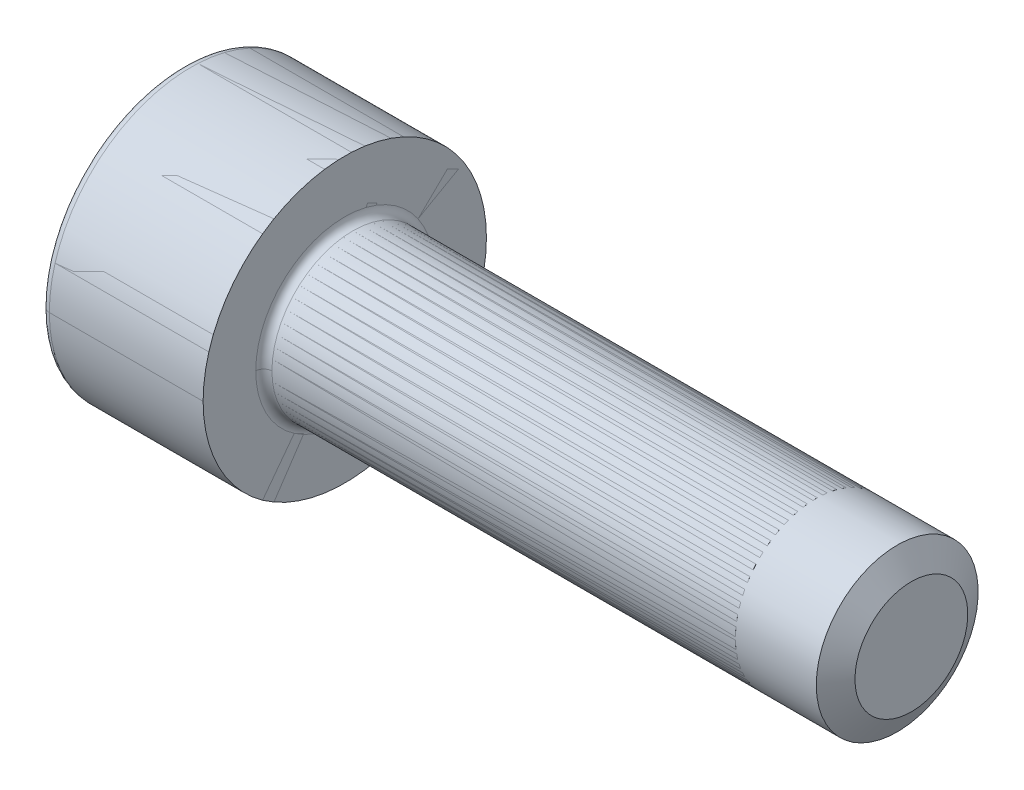
ISO-10303-21;
HEADER;
FILE_DESCRIPTION(('STEP AP214'),'2;1');
FILE_NAME('part.step','',(''),(''),'','','');
FILE_SCHEMA(('AUTOMOTIVE_DESIGN { 1 0 10303 214 1 1 1 1 }'));
ENDSEC;
DATA;
#1=APPLICATION_CONTEXT('core data for automotive mechanical design processes');
#2=APPLICATION_PROTOCOL_DEFINITION('international standard','automotive_design',2000,#1);
#3=PRODUCT_CONTEXT('',#1,'mechanical');
#4=PRODUCT('Part','Part','',(#3));
#5=PRODUCT_RELATED_PRODUCT_CATEGORY('part','',(#4));
#6=PRODUCT_DEFINITION_FORMATION('','',#4);
#7=PRODUCT_DEFINITION_CONTEXT('part definition',#1,'design');
#8=PRODUCT_DEFINITION('design','',#6,#7);
#9=PRODUCT_DEFINITION_SHAPE('','',#8);
#10=(LENGTH_UNIT() NAMED_UNIT(*) SI_UNIT(.MILLI.,.METRE.));
#11=(NAMED_UNIT(*) PLANE_ANGLE_UNIT() SI_UNIT($,.RADIAN.));
#12=(NAMED_UNIT(*) SI_UNIT($,.STERADIAN.) SOLID_ANGLE_UNIT());
#13=UNCERTAINTY_MEASURE_WITH_UNIT(LENGTH_MEASURE(1.E-05),#10,'distance_accuracy_value','');
#14=(GEOMETRIC_REPRESENTATION_CONTEXT(3) GLOBAL_UNCERTAINTY_ASSIGNED_CONTEXT((#13)) GLOBAL_UNIT_ASSIGNED_CONTEXT((#10,
#11,#12)) REPRESENTATION_CONTEXT('',''));
#15=CARTESIAN_POINT('',(0.,0.,0.));
#16=DIRECTION('',(0.,0.,1.));
#17=DIRECTION('',(1.,0.,0.));
#18=AXIS2_PLACEMENT_3D('',#15,#16,#17);
#19=CARTESIAN_POINT('',(0.2,0.,0.));
#20=DIRECTION('',(-1.,0.,0.));
#21=DIRECTION('',(0.,0.,1.));
#22=AXIS2_PLACEMENT_3D('',#19,#20,#21);
#23=TOROIDAL_SURFACE('',#22,3.3,0.2);
#24=CARTESIAN_POINT('',(0.2,0.,-3.3));
#25=DIRECTION('',(0.,1.,0.));
#26=DIRECTION('',(0.,0.,1.));
#27=AXIS2_PLACEMENT_3D('',#24,#25,#26);
#28=CIRCLE('',#27,0.2);
#29=CARTESIAN_POINT('',(0.2,0.,-3.5));
#30=VERTEX_POINT('',#29);
#31=CARTESIAN_POINT('',(0.,0.,-3.3));
#32=VERTEX_POINT('',#31);
#33=EDGE_CURVE('P0_E161',#30,#32,#28,.T.);
#34=ORIENTED_EDGE('',*,*,#33,.F.);
#35=CARTESIAN_POINT('',(0.2,0.,0.));
#36=DIRECTION('',(1.,0.,0.));
#37=DIRECTION('',(0.,0.,1.));
#38=AXIS2_PLACEMENT_3D('',#35,#36,#37);
#39=CIRCLE('',#38,3.5);
#40=CARTESIAN_POINT('',(0.2,0.,3.5));
#41=VERTEX_POINT('',#40);
#42=EDGE_CURVE('P0_E155',#41,#30,#39,.T.);
#43=ORIENTED_EDGE('',*,*,#42,.F.);
#44=CARTESIAN_POINT('',(0.2,0.,3.3));
#45=DIRECTION('',(0.,-1.,0.));
#46=DIRECTION('',(0.,0.,-1.));
#47=AXIS2_PLACEMENT_3D('',#44,#45,#46);
#48=CIRCLE('',#47,0.2);
#49=CARTESIAN_POINT('',(0.,0.,3.3));
#50=VERTEX_POINT('',#49);
#51=EDGE_CURVE('P0_E158',#41,#50,#48,.T.);
#52=ORIENTED_EDGE('',*,*,#51,.T.);
#53=CARTESIAN_POINT('',(0.,0.,0.));
#54=DIRECTION('',(-1.,0.,0.));
#55=DIRECTION('',(0.,0.,1.));
#56=AXIS2_PLACEMENT_3D('',#53,#54,#55);
#57=CIRCLE('',#56,3.3);
#58=EDGE_CURVE('P0_E42',#32,#50,#57,.T.);
#59=ORIENTED_EDGE('',*,*,#58,.F.);
#60=EDGE_LOOP('',(#34,#43,#52,#59));
#61=FACE_BOUND('',#60,.T.);
#62=ADVANCED_FACE('P0_F38',(#61),#23,.T.);
#63=CARTESIAN_POINT('',(2.,-0.86,1.48956369450923));
#64=DIRECTION('',(-1.,0.,0.));
#65=DIRECTION('',(0.,0.,1.));
#66=AXIS2_PLACEMENT_3D('',#63,#64,#65);
#67=PLANE('',#66);
#68=DIRECTION('',(0.,0.5,0.866025403784439));
#69=VECTOR('',#68,1.);
#70=CARTESIAN_POINT('',(2.,-1.72,0.));
#71=LINE('',#70,#69);
#72=CARTESIAN_POINT('',(2.,-1.72,0.));
#73=VERTEX_POINT('',#72);
#74=CARTESIAN_POINT('',(2.,-0.86,1.48956369450923));
#75=VERTEX_POINT('',#74);
#76=EDGE_CURVE('P0_E295',#73,#75,#71,.T.);
#77=ORIENTED_EDGE('',*,*,#76,.T.);
#78=DIRECTION('',(0.,1.,0.));
#79=VECTOR('',#78,1.);
#80=CARTESIAN_POINT('',(2.,-0.86,1.48956369450923));
#81=LINE('',#80,#79);
#82=CARTESIAN_POINT('',(2.,0.86,1.48956369450923));
#83=VERTEX_POINT('',#82);
#84=EDGE_CURVE('P0_E11',#75,#83,#81,.T.);
#85=ORIENTED_EDGE('',*,*,#84,.T.);
#86=DIRECTION('',(0.,0.5,-0.866025403784439));
#87=VECTOR('',#86,1.);
#88=CARTESIAN_POINT('',(2.,0.86,1.48956369450923));
#89=LINE('',#88,#87);
#90=CARTESIAN_POINT('',(2.,1.72,0.));
#91=VERTEX_POINT('',#90);
#92=EDGE_CURVE('P0_E220',#83,#91,#89,.T.);
#93=ORIENTED_EDGE('',*,*,#92,.T.);
#94=DIRECTION('',(0.,-0.5,-0.866025403784439));
#95=VECTOR('',#94,1.);
#96=CARTESIAN_POINT('',(2.,1.72,0.));
#97=LINE('',#96,#95);
#98=CARTESIAN_POINT('',(2.,0.86,-1.48956369450923));
#99=VERTEX_POINT('',#98);
#100=EDGE_CURVE('P0_E221',#91,#99,#97,.T.);
#101=ORIENTED_EDGE('',*,*,#100,.T.);
#102=DIRECTION('',(0.,-1.,0.));
#103=VECTOR('',#102,1.);
#104=CARTESIAN_POINT('',(2.,0.86,-1.48956369450923));
#105=LINE('',#104,#103);
#106=CARTESIAN_POINT('',(2.,-0.86,-1.48956369450923));
#107=VERTEX_POINT('',#106);
#108=EDGE_CURVE('P0_E134',#99,#107,#105,.T.);
#109=ORIENTED_EDGE('',*,*,#108,.T.);
#110=DIRECTION('',(0.,-0.5,0.866025403784439));
#111=VECTOR('',#110,1.);
#112=CARTESIAN_POINT('',(2.,-0.86,-1.48956369450923));
#113=LINE('',#112,#111);
#114=EDGE_CURVE('P0_E126',#107,#73,#113,.T.);
#115=ORIENTED_EDGE('',*,*,#114,.T.);
#116=EDGE_LOOP('',(#77,#85,#93,#101,#109,#115));
#117=FACE_BOUND('',#116,.T.);
#118=ADVANCED_FACE('P0_F333',(#117),#67,.T.);
#119=CARTESIAN_POINT('',(2.,-0.86,1.48956369450923));
#120=DIRECTION('',(0.,0.,1.));
#121=DIRECTION('',(0.,-1.,0.));
#122=AXIS2_PLACEMENT_3D('',#119,#120,#121);
#123=PLANE('',#122);
#124=DIRECTION('',(0.,1.,0.));
#125=VECTOR('',#124,1.);
#126=CARTESIAN_POINT('',(0.,-0.86,1.48956369450923));
#127=LINE('',#126,#125);
#128=CARTESIAN_POINT('',(0.,-0.86,1.48956369450923));
#129=VERTEX_POINT('',#128);
#130=CARTESIAN_POINT('',(0.,0.86,1.48956369450923));
#131=VERTEX_POINT('',#130);
#132=EDGE_CURVE('P0_E168',#129,#131,#127,.T.);
#133=ORIENTED_EDGE('',*,*,#132,.T.);
#134=DIRECTION('',(-1.,0.,0.));
#135=VECTOR('',#134,1.);
#136=CARTESIAN_POINT('',(2.,0.86,1.48956369450923));
#137=LINE('',#136,#135);
#138=EDGE_CURVE('P0_E49',#83,#131,#137,.T.);
#139=ORIENTED_EDGE('',*,*,#138,.F.);
#140=ORIENTED_EDGE('',*,*,#84,.F.);
#141=DIRECTION('',(-1.,0.,0.));
#142=VECTOR('',#141,1.);
#143=CARTESIAN_POINT('',(2.,-0.86,1.48956369450923));
#144=LINE('',#143,#142);
#145=EDGE_CURVE('P0_E293',#75,#129,#144,.T.);
#146=ORIENTED_EDGE('',*,*,#145,.T.);
#147=EDGE_LOOP('',(#133,#139,#140,#146));
#148=FACE_BOUND('',#147,.T.);
#149=ADVANCED_FACE('P0_F330',(#148),#123,.F.);
#150=CARTESIAN_POINT('',(2.,0.86,1.48956369450923));
#151=DIRECTION('',(0.,0.866025403784439,0.5));
#152=DIRECTION('',(1.,0.,0.));
#153=AXIS2_PLACEMENT_3D('',#150,#151,#152);
#154=PLANE('',#153);
#155=DIRECTION('',(0.,0.5,-0.866025403784439));
#156=VECTOR('',#155,1.);
#157=CARTESIAN_POINT('',(0.,0.86,1.48956369450923));
#158=LINE('',#157,#156);
#159=CARTESIAN_POINT('',(0.,1.72,0.));
#160=VERTEX_POINT('',#159);
#161=EDGE_CURVE('P0_E255',#131,#160,#158,.T.);
#162=ORIENTED_EDGE('',*,*,#161,.T.);
#163=DIRECTION('',(-1.,0.,0.));
#164=VECTOR('',#163,1.);
#165=CARTESIAN_POINT('',(2.,1.72,0.));
#166=LINE('',#165,#164);
#167=EDGE_CURVE('P0_E218',#91,#160,#166,.T.);
#168=ORIENTED_EDGE('',*,*,#167,.F.);
#169=ORIENTED_EDGE('',*,*,#92,.F.);
#170=ORIENTED_EDGE('',*,*,#138,.T.);
#171=EDGE_LOOP('',(#162,#168,#169,#170));
#172=FACE_BOUND('',#171,.T.);
#173=ADVANCED_FACE('P0_F332',(#172),#154,.F.);
#174=CARTESIAN_POINT('',(2.,1.72,0.));
#175=DIRECTION('',(0.,0.866025403784439,-0.5));
#176=DIRECTION('',(-1.,0.,0.));
#177=AXIS2_PLACEMENT_3D('',#174,#175,#176);
#178=PLANE('',#177);
#179=DIRECTION('',(0.,-0.5,-0.866025403784439));
#180=VECTOR('',#179,1.);
#181=CARTESIAN_POINT('',(0.,1.72,0.));
#182=LINE('',#181,#180);
#183=CARTESIAN_POINT('',(0.,0.86,-1.48956369450923));
#184=VERTEX_POINT('',#183);
#185=EDGE_CURVE('P0_E202',#160,#184,#182,.T.);
#186=ORIENTED_EDGE('',*,*,#185,.T.);
#187=DIRECTION('',(-1.,0.,0.));
#188=VECTOR('',#187,1.);
#189=CARTESIAN_POINT('',(2.,0.86,-1.48956369450923));
#190=LINE('',#189,#188);
#191=EDGE_CURVE('P0_E251',#99,#184,#190,.T.);
#192=ORIENTED_EDGE('',*,*,#191,.F.);
#193=ORIENTED_EDGE('',*,*,#100,.F.);
#194=ORIENTED_EDGE('',*,*,#167,.T.);
#195=EDGE_LOOP('',(#186,#192,#193,#194));
#196=FACE_BOUND('',#195,.T.);
#197=ADVANCED_FACE('P0_F271',(#196),#178,.F.);
#198=CARTESIAN_POINT('',(2.,0.86,-1.48956369450923));
#199=DIRECTION('',(0.,0.,-1.));
#200=DIRECTION('',(0.,-1.,0.));
#201=AXIS2_PLACEMENT_3D('',#198,#199,#200);
#202=PLANE('',#201);
#203=DIRECTION('',(0.,-1.,0.));
#204=VECTOR('',#203,1.);
#205=CARTESIAN_POINT('',(0.,0.86,-1.48956369450923));
#206=LINE('',#205,#204);
#207=CARTESIAN_POINT('',(0.,-0.86,-1.48956369450923));
#208=VERTEX_POINT('',#207);
#209=EDGE_CURVE('P0_E239',#184,#208,#206,.T.);
#210=ORIENTED_EDGE('',*,*,#209,.T.);
#211=DIRECTION('',(-1.,0.,0.));
#212=VECTOR('',#211,1.);
#213=CARTESIAN_POINT('',(2.,-0.86,-1.48956369450923));
#214=LINE('',#213,#212);
#215=EDGE_CURVE('P0_E227',#107,#208,#214,.T.);
#216=ORIENTED_EDGE('',*,*,#215,.F.);
#217=ORIENTED_EDGE('',*,*,#108,.F.);
#218=ORIENTED_EDGE('',*,*,#191,.T.);
#219=EDGE_LOOP('',(#210,#216,#217,#218));
#220=FACE_BOUND('',#219,.T.);
#221=ADVANCED_FACE('P0_F281',(#220),#202,.F.);
#222=CARTESIAN_POINT('',(2.,-0.86,-1.48956369450923));
#223=DIRECTION('',(0.,-0.866025403784439,-0.5));
#224=DIRECTION('',(0.,0.5,-0.866025403784439));
#225=AXIS2_PLACEMENT_3D('',#222,#223,#224);
#226=PLANE('',#225);
#227=DIRECTION('',(0.,-0.5,0.866025403784439));
#228=VECTOR('',#227,1.);
#229=CARTESIAN_POINT('',(0.,-0.86,-1.48956369450923));
#230=LINE('',#229,#228);
#231=CARTESIAN_POINT('',(0.,-1.72,0.));
#232=VERTEX_POINT('',#231);
#233=EDGE_CURVE('P0_E238',#208,#232,#230,.T.);
#234=ORIENTED_EDGE('',*,*,#233,.T.);
#235=DIRECTION('',(-1.,0.,0.));
#236=VECTOR('',#235,1.);
#237=CARTESIAN_POINT('',(2.,-1.72,0.));
#238=LINE('',#237,#236);
#239=EDGE_CURVE('P0_E248',#73,#232,#238,.T.);
#240=ORIENTED_EDGE('',*,*,#239,.F.);
#241=ORIENTED_EDGE('',*,*,#114,.F.);
#242=ORIENTED_EDGE('',*,*,#215,.T.);
#243=EDGE_LOOP('',(#234,#240,#241,#242));
#244=FACE_BOUND('',#243,.T.);
#245=ADVANCED_FACE('P0_F327',(#244),#226,.F.);
#246=CARTESIAN_POINT('',(2.,-1.72,0.));
#247=DIRECTION('',(0.,-0.866025403784439,0.5));
#248=DIRECTION('',(-1.,0.,0.));
#249=AXIS2_PLACEMENT_3D('',#246,#247,#248);
#250=PLANE('',#249);
#251=DIRECTION('',(0.,0.5,0.866025403784439));
#252=VECTOR('',#251,1.);
#253=CARTESIAN_POINT('',(0.,-1.72,0.));
#254=LINE('',#253,#252);
#255=EDGE_CURVE('P0_E234',#232,#129,#254,.T.);
#256=ORIENTED_EDGE('',*,*,#255,.T.);
#257=ORIENTED_EDGE('',*,*,#145,.F.);
#258=ORIENTED_EDGE('',*,*,#76,.F.);
#259=ORIENTED_EDGE('',*,*,#239,.T.);
#260=EDGE_LOOP('',(#256,#257,#258,#259));
#261=FACE_BOUND('',#260,.T.);
#262=ADVANCED_FACE('P0_F325',(#261),#250,.F.);
#263=CARTESIAN_POINT('',(4.2,0.,0.));
#264=DIRECTION('',(1.,0.,0.));
#265=DIRECTION('',(0.,0.,-1.));
#266=AXIS2_PLACEMENT_3D('',#263,#264,#265);
#267=TOROIDAL_SURFACE('',#266,2.2,0.2);
#268=CARTESIAN_POINT('',(4.2,0.,2.2));
#269=DIRECTION('',(0.,1.,0.));
#270=DIRECTION('',(0.,0.,1.));
#271=AXIS2_PLACEMENT_3D('',#268,#269,#270);
#272=CIRCLE('',#271,0.2);
#273=CARTESIAN_POINT('',(4.2,0.,2.));
#274=VERTEX_POINT('',#273);
#275=CARTESIAN_POINT('',(4.,0.,2.2));
#276=VERTEX_POINT('',#275);
#277=EDGE_CURVE('P0_E300',#274,#276,#272,.T.);
#278=ORIENTED_EDGE('',*,*,#277,.F.);
#279=CARTESIAN_POINT('',(4.2,0.,0.));
#280=DIRECTION('',(1.,0.,0.));
#281=DIRECTION('',(0.,0.,-1.));
#282=AXIS2_PLACEMENT_3D('',#279,#280,#281);
#283=CIRCLE('',#282,2.);
#284=CARTESIAN_POINT('',(4.2,0.,-2.));
#285=VERTEX_POINT('',#284);
#286=EDGE_CURVE('P0_E204',#285,#274,#283,.T.);
#287=ORIENTED_EDGE('',*,*,#286,.F.);
#288=CARTESIAN_POINT('',(4.2,0.,-2.2));
#289=DIRECTION('',(0.,-1.,0.));
#290=DIRECTION('',(0.,0.,-1.));
#291=AXIS2_PLACEMENT_3D('',#288,#289,#290);
#292=CIRCLE('',#291,0.2);
#293=CARTESIAN_POINT('',(4.,0.,-2.2));
#294=VERTEX_POINT('',#293);
#295=EDGE_CURVE('P0_E179',#285,#294,#292,.T.);
#296=ORIENTED_EDGE('',*,*,#295,.T.);
#297=CARTESIAN_POINT('',(4.,0.,0.));
#298=DIRECTION('',(1.,0.,0.));
#299=DIRECTION('',(0.,0.,-1.));
#300=AXIS2_PLACEMENT_3D('',#297,#298,#299);
#301=CIRCLE('',#300,2.2);
#302=EDGE_CURVE('P0_E245',#294,#276,#301,.T.);
#303=ORIENTED_EDGE('',*,*,#302,.T.);
#304=EDGE_LOOP('',(#278,#287,#296,#303));
#305=FACE_BOUND('',#304,.T.);
#306=ADVANCED_FACE('P0_F357',(#305),#267,.F.);
#307=CARTESIAN_POINT('',(4.,3.5,0.));
#308=DIRECTION('',(1.,0.,0.));
#309=DIRECTION('',(0.,1.,0.));
#310=AXIS2_PLACEMENT_3D('',#307,#308,#309);
#311=PLANE('',#310);
#312=ORIENTED_EDGE('',*,*,#302,.F.);
#313=CARTESIAN_POINT('',(4.,0.,0.));
#314=DIRECTION('',(1.,0.,0.));
#315=DIRECTION('',(0.,0.,-1.));
#316=AXIS2_PLACEMENT_3D('',#313,#314,#315);
#317=CIRCLE('',#316,2.2);
#318=EDGE_CURVE('P0_E303',#276,#294,#317,.T.);
#319=ORIENTED_EDGE('',*,*,#318,.F.);
#320=EDGE_LOOP('',(#312,#319));
#321=FACE_BOUND('',#320,.T.);
#322=CARTESIAN_POINT('',(4.,0.,0.));
#323=DIRECTION('',(1.,0.,0.));
#324=DIRECTION('',(0.,0.,-1.));
#325=AXIS2_PLACEMENT_3D('',#322,#323,#324);
#326=CIRCLE('',#325,3.5);
#327=CARTESIAN_POINT('',(4.,0.,-3.5));
#328=VERTEX_POINT('',#327);
#329=CARTESIAN_POINT('',(4.,0.,3.5));
#330=VERTEX_POINT('',#329);
#331=EDGE_CURVE('P0_E178',#328,#330,#326,.T.);
#332=ORIENTED_EDGE('',*,*,#331,.T.);
#333=CARTESIAN_POINT('',(4.,0.,0.));
#334=DIRECTION('',(1.,0.,0.));
#335=DIRECTION('',(0.,0.,-1.));
#336=AXIS2_PLACEMENT_3D('',#333,#334,#335);
#337=CIRCLE('',#336,3.5);
#338=EDGE_CURVE('P0_E167',#330,#328,#337,.T.);
#339=ORIENTED_EDGE('',*,*,#338,.T.);
#340=EDGE_LOOP('',(#332,#339));
#341=FACE_BOUND('',#340,.T.);
#342=ADVANCED_FACE('P0_F366',(#321,#341),#311,.T.);
#343=CARTESIAN_POINT('',(0.,0.,0.));
#344=DIRECTION('',(1.,0.,0.));
#345=DIRECTION('',(0.,0.,-1.));
#346=AXIS2_PLACEMENT_3D('',#343,#344,#345);
#347=CYLINDRICAL_SURFACE('',#346,3.5);
#348=DIRECTION('',(1.,0.,0.));
#349=VECTOR('',#348,1.);
#350=CARTESIAN_POINT('',(0.,0.,3.5));
#351=LINE('',#350,#349);
#352=EDGE_CURVE('P0_E171',#41,#330,#351,.T.);
#353=ORIENTED_EDGE('',*,*,#352,.F.);
#354=ORIENTED_EDGE('',*,*,#42,.T.);
#355=DIRECTION('',(1.,0.,0.));
#356=VECTOR('',#355,1.);
#357=CARTESIAN_POINT('',(0.,0.,-3.5));
#358=LINE('',#357,#356);
#359=EDGE_CURVE('P0_E189',#30,#328,#358,.T.);
#360=ORIENTED_EDGE('',*,*,#359,.T.);
#361=ORIENTED_EDGE('',*,*,#338,.F.);
#362=EDGE_LOOP('',(#353,#354,#360,#361));
#363=FACE_BOUND('',#362,.T.);
#364=ADVANCED_FACE('P0_F172',(#363),#347,.T.);
#365=CARTESIAN_POINT('',(0.,0.,0.));
#366=DIRECTION('',(-1.,0.,0.));
#367=DIRECTION('',(0.,0.,1.));
#368=AXIS2_PLACEMENT_3D('',#365,#366,#367);
#369=PLANE('',#368);
#370=ORIENTED_EDGE('',*,*,#255,.F.);
#371=ORIENTED_EDGE('',*,*,#233,.F.);
#372=ORIENTED_EDGE('',*,*,#209,.F.);
#373=ORIENTED_EDGE('',*,*,#185,.F.);
#374=ORIENTED_EDGE('',*,*,#161,.F.);
#375=ORIENTED_EDGE('',*,*,#132,.F.);
#376=EDGE_LOOP('',(#370,#371,#372,#373,#374,#375));
#377=FACE_BOUND('',#376,.T.);
#378=CARTESIAN_POINT('',(0.,0.,0.));
#379=DIRECTION('',(-1.,0.,0.));
#380=DIRECTION('',(0.,0.,1.));
#381=AXIS2_PLACEMENT_3D('',#378,#379,#380);
#382=CIRCLE('',#381,3.3);
#383=EDGE_CURVE('P0_E184',#50,#32,#382,.T.);
#384=ORIENTED_EDGE('',*,*,#383,.T.);
#385=ORIENTED_EDGE('',*,*,#58,.T.);
#386=EDGE_LOOP('',(#384,#385));
#387=FACE_BOUND('',#386,.T.);
#388=ADVANCED_FACE('P0_F277',(#377,#387),#369,.T.);
#389=CARTESIAN_POINT('',(0.,0.,0.));
#390=DIRECTION('',(1.,0.,0.));
#391=DIRECTION('',(0.,0.,-1.));
#392=AXIS2_PLACEMENT_3D('',#389,#390,#391);
#393=CYLINDRICAL_SURFACE('',#392,2.);
#394=ORIENTED_EDGE('',*,*,#286,.T.);
#395=DIRECTION('',(1.,0.,0.));
#396=VECTOR('',#395,1.);
#397=CARTESIAN_POINT('',(0.,0.,2.));
#398=LINE('',#397,#396);
#399=CARTESIAN_POINT('',(15.65,0.,2.));
#400=VERTEX_POINT('',#399);
#401=EDGE_CURVE('P0_E209',#274,#400,#398,.T.);
#402=ORIENTED_EDGE('',*,*,#401,.T.);
#403=ORIENTED_EDGE('',*,*,#401,.F.);
#404=CARTESIAN_POINT('',(4.2,0.,0.));
#405=DIRECTION('',(1.,0.,0.));
#406=DIRECTION('',(0.,0.,-1.));
#407=AXIS2_PLACEMENT_3D('',#404,#405,#406);
#408=CIRCLE('',#407,2.);
#409=EDGE_CURVE('P0_E186',#274,#285,#408,.T.);
#410=ORIENTED_EDGE('',*,*,#409,.T.);
#411=DIRECTION('',(1.,0.,0.));
#412=VECTOR('',#411,1.);
#413=CARTESIAN_POINT('',(0.,0.,-2.));
#414=LINE('',#413,#412);
#415=CARTESIAN_POINT('',(15.65,0.,-2.));
#416=VERTEX_POINT('',#415);
#417=EDGE_CURVE('P0_E226',#285,#416,#414,.T.);
#418=ORIENTED_EDGE('',*,*,#417,.T.);
#419=ORIENTED_EDGE('',*,*,#417,.F.);
#420=EDGE_LOOP('',(#394,#402,#403,#410,#418,#419));
#421=FACE_BOUND('',#420,.T.);
#422=CARTESIAN_POINT('',(17.65,0.,0.));
#423=DIRECTION('',(-1.,0.,0.));
#424=DIRECTION('',(0.,0.,1.));
#425=AXIS2_PLACEMENT_3D('',#422,#423,#424);
#426=CIRCLE('',#425,2.);
#427=CARTESIAN_POINT('',(17.65,0.,2.));
#428=VERTEX_POINT('',#427);
#429=EDGE_CURVE('P0_E191',#428,#428,#426,.T.);
#430=ORIENTED_EDGE('',*,*,#429,.T.);
#431=EDGE_LOOP('',(#430));
#432=FACE_BOUND('',#431,.T.);
#433=ADVANCED_FACE('P0_F360',(#421,#432),#393,.T.);
#434=CARTESIAN_POINT('',(0.,0.,0.));
#435=DIRECTION('',(1.,0.,0.));
#436=DIRECTION('',(0.,0.,-1.));
#437=AXIS2_PLACEMENT_3D('',#434,#435,#436);
#438=CYLINDRICAL_SURFACE('',#437,3.5);
#439=CARTESIAN_POINT('',(0.2,0.,0.));
#440=DIRECTION('',(1.,0.,0.));
#441=DIRECTION('',(0.,0.,1.));
#442=AXIS2_PLACEMENT_3D('',#439,#440,#441);
#443=CIRCLE('',#442,3.5);
#444=EDGE_CURVE('P0_E182',#30,#41,#443,.T.);
#445=ORIENTED_EDGE('',*,*,#444,.T.);
#446=ORIENTED_EDGE('',*,*,#352,.T.);
#447=ORIENTED_EDGE('',*,*,#331,.F.);
#448=ORIENTED_EDGE('',*,*,#359,.F.);
#449=EDGE_LOOP('',(#445,#446,#447,#448));
#450=FACE_BOUND('',#449,.T.);
#451=ADVANCED_FACE('P0_F188',(#450),#438,.T.);
#452=CARTESIAN_POINT('',(4.2,0.,0.));
#453=DIRECTION('',(1.,0.,0.));
#454=DIRECTION('',(0.,0.,-1.));
#455=AXIS2_PLACEMENT_3D('',#452,#453,#454);
#456=TOROIDAL_SURFACE('',#455,2.2,0.2);
#457=ORIENTED_EDGE('',*,*,#409,.F.);
#458=ORIENTED_EDGE('',*,*,#277,.T.);
#459=ORIENTED_EDGE('',*,*,#318,.T.);
#460=ORIENTED_EDGE('',*,*,#295,.F.);
#461=EDGE_LOOP('',(#457,#458,#459,#460));
#462=FACE_BOUND('',#461,.T.);
#463=ADVANCED_FACE('P0_F372',(#462),#456,.F.);
#464=CARTESIAN_POINT('',(0.2,0.,0.));
#465=DIRECTION('',(-1.,0.,0.));
#466=DIRECTION('',(0.,0.,1.));
#467=AXIS2_PLACEMENT_3D('',#464,#465,#466);
#468=TOROIDAL_SURFACE('',#467,3.3,0.2);
#469=ORIENTED_EDGE('',*,*,#444,.F.);
#470=ORIENTED_EDGE('',*,*,#33,.T.);
#471=ORIENTED_EDGE('',*,*,#383,.F.);
#472=ORIENTED_EDGE('',*,*,#51,.F.);
#473=EDGE_LOOP('',(#469,#470,#471,#472));
#474=FACE_BOUND('',#473,.T.);
#475=ADVANCED_FACE('P0_F40',(#474),#468,.T.);
#476=CARTESIAN_POINT('',(18.,0.,0.));
#477=DIRECTION('',(-1.,0.,0.));
#478=DIRECTION('',(0.,0.,1.));
#479=AXIS2_PLACEMENT_3D('',#476,#477,#478);
#480=CONICAL_SURFACE('',#479,1.3938,1.04718484902492);
#481=ORIENTED_EDGE('',*,*,#429,.F.);
#482=EDGE_LOOP('',(#481));
#483=FACE_BOUND('',#482,.T.);
#484=CARTESIAN_POINT('',(18.,0.,0.));
#485=DIRECTION('',(-1.,0.,0.));
#486=DIRECTION('',(0.,0.,1.));
#487=AXIS2_PLACEMENT_3D('',#484,#485,#486);
#488=CIRCLE('',#487,1.3938);
#489=CARTESIAN_POINT('',(18.,0.,1.3938));
#490=VERTEX_POINT('',#489);
#491=EDGE_CURVE('P0_E199',#490,#490,#488,.T.);
#492=ORIENTED_EDGE('',*,*,#491,.T.);
#493=EDGE_LOOP('',(#492));
#494=FACE_BOUND('',#493,.T.);
#495=ADVANCED_FACE('P0_F353',(#483,#494),#480,.T.);
#496=CARTESIAN_POINT('',(18.,0.,0.));
#497=DIRECTION('',(-1.,0.,0.));
#498=DIRECTION('',(0.,0.,1.));
#499=AXIS2_PLACEMENT_3D('',#496,#497,#498);
#500=PLANE('',#499);
#501=ORIENTED_EDGE('',*,*,#491,.F.);
#502=EDGE_LOOP('',(#501));
#503=FACE_BOUND('',#502,.T.);
#504=ADVANCED_FACE('P0_F404',(#503),#500,.F.);
#505=CLOSED_SHELL('',(#62,#118,#149,#173,#197,#221,#245,#262,#306,#342,#364,#388,#433,#451,#463,
#475,#495,#504));
#506=MANIFOLD_SOLID_BREP('P0_B2',#505);
#507=CARTESIAN_POINT('',(16.,2.,0.));
#508=DIRECTION('',(1.,0.,0.));
#509=DIRECTION('',(0.,1.,0.));
#510=AXIS2_PLACEMENT_3D('',#507,#508,#509);
#511=PLANE('',#510);
#512=CARTESIAN_POINT('',(16.,0.,0.));
#513=DIRECTION('',(-1.,0.,0.));
#514=DIRECTION('',(0.,0.,1.));
#515=AXIS2_PLACEMENT_3D('',#512,#513,#514);
#516=CIRCLE('',#515,1.3938);
#517=CARTESIAN_POINT('',(16.,0.,1.3938));
#518=VERTEX_POINT('',#517);
#519=CARTESIAN_POINT('',(16.,0.,-1.3938));
#520=VERTEX_POINT('',#519);
#521=EDGE_CURVE('P1_E257',#518,#520,#516,.T.);
#522=ORIENTED_EDGE('',*,*,#521,.F.);
#523=CARTESIAN_POINT('',(16.,0.,0.));
#524=DIRECTION('',(-1.,0.,0.));
#525=DIRECTION('',(0.,0.,1.));
#526=AXIS2_PLACEMENT_3D('',#523,#524,#525);
#527=CIRCLE('',#526,1.3938);
#528=EDGE_CURVE('P1_E11',#520,#518,#527,.T.);
#529=ORIENTED_EDGE('',*,*,#528,.F.);
#530=EDGE_LOOP('',(#522,#529));
#531=FACE_BOUND('',#530,.T.);
#532=ADVANCED_FACE('P1_F16',(#531),#511,.T.);
#533=CARTESIAN_POINT('',(15.65,0.,0.));
#534=DIRECTION('',(-1.,0.,0.));
#535=DIRECTION('',(0.,0.,1.));
#536=AXIS2_PLACEMENT_3D('',#533,#534,#535);
#537=CONICAL_SURFACE('',#536,2.,1.04718484902493);
#538=DIRECTION('',(-0.500011000363013,0.,-0.866019052628739));
#539=VECTOR('',#538,1.);
#540=CARTESIAN_POINT('',(15.65,0.,-2.));
#541=LINE('',#540,#539);
#542=CARTESIAN_POINT('',(15.65,0.,-2.));
#543=VERTEX_POINT('',#542);
#544=EDGE_CURVE('P1_E230',#520,#543,#541,.T.);
#545=ORIENTED_EDGE('',*,*,#544,.F.);
#546=ORIENTED_EDGE('',*,*,#528,.T.);
#547=DIRECTION('',(-0.500011000363013,0.,0.866019052628739));
#548=VECTOR('',#547,1.);
#549=CARTESIAN_POINT('',(15.65,0.,2.));
#550=LINE('',#549,#548);
#551=CARTESIAN_POINT('',(15.65,0.,2.));
#552=VERTEX_POINT('',#551);
#553=EDGE_CURVE('P1_E20',#518,#552,#550,.T.);
#554=ORIENTED_EDGE('',*,*,#553,.T.);
#555=CARTESIAN_POINT('',(15.65,0.,0.));
#556=DIRECTION('',(-1.,0.,0.));
#557=DIRECTION('',(0.,0.,1.));
#558=AXIS2_PLACEMENT_3D('',#555,#556,#557);
#559=CIRCLE('',#558,2.);
#560=EDGE_CURVE('P1_E207',#543,#552,#559,.T.);
#561=ORIENTED_EDGE('',*,*,#560,.F.);
#562=EDGE_LOOP('',(#545,#546,#554,#561));
#563=FACE_BOUND('',#562,.T.);
#564=ADVANCED_FACE('P1_F353',(#563),#537,.T.);
#565=CARTESIAN_POINT('',(0.2,0.,0.));
#566=DIRECTION('',(-1.,0.,0.));
#567=DIRECTION('',(0.,0.,1.));
#568=AXIS2_PLACEMENT_3D('',#565,#566,#567);
#569=TOROIDAL_SURFACE('',#568,3.3,0.2);
#570=CARTESIAN_POINT('',(0.2,0.,-3.3));
#571=DIRECTION('',(0.,1.,0.));
#572=DIRECTION('',(0.,0.,1.));
#573=AXIS2_PLACEMENT_3D('',#570,#571,#572);
#574=CIRCLE('',#573,0.2);
#575=CARTESIAN_POINT('',(0.2,0.,-3.5));
#576=VERTEX_POINT('',#575);
#577=CARTESIAN_POINT('',(0.,0.,-3.3));
#578=VERTEX_POINT('',#577);
#579=EDGE_CURVE('P1_E198',#576,#578,#574,.T.);
#580=ORIENTED_EDGE('',*,*,#579,.F.);
#581=CARTESIAN_POINT('',(0.2,0.,0.));
#582=DIRECTION('',(1.,0.,0.));
#583=DIRECTION('',(0.,0.,1.));
#584=AXIS2_PLACEMENT_3D('',#581,#582,#583);
#585=CIRCLE('',#584,3.5);
#586=CARTESIAN_POINT('',(0.2,0.,3.5));
#587=VERTEX_POINT('',#586);
#588=EDGE_CURVE('P1_E246',#587,#576,#585,.T.);
#589=ORIENTED_EDGE('',*,*,#588,.F.);
#590=CARTESIAN_POINT('',(0.2,0.,3.3));
#591=DIRECTION('',(0.,-1.,0.));
#592=DIRECTION('',(0.,0.,-1.));
#593=AXIS2_PLACEMENT_3D('',#590,#591,#592);
#594=CIRCLE('',#593,0.2);
#595=CARTESIAN_POINT('',(0.,0.,3.3));
#596=VERTEX_POINT('',#595);
#597=EDGE_CURVE('P1_E288',#587,#596,#594,.T.);
#598=ORIENTED_EDGE('',*,*,#597,.T.);
#599=CARTESIAN_POINT('',(0.,0.,0.));
#600=DIRECTION('',(-1.,0.,0.));
#601=DIRECTION('',(0.,0.,1.));
#602=AXIS2_PLACEMENT_3D('',#599,#600,#601);
#603=CIRCLE('',#602,3.3);
#604=EDGE_CURVE('P1_E204',#578,#596,#603,.T.);
#605=ORIENTED_EDGE('',*,*,#604,.F.);
#606=EDGE_LOOP('',(#580,#589,#598,#605));
#607=FACE_BOUND('',#606,.T.);
#608=ADVANCED_FACE('P1_F344',(#607),#569,.T.);
#609=CARTESIAN_POINT('',(2.,-0.86,1.48956369450923));
#610=DIRECTION('',(-1.,0.,0.));
#611=DIRECTION('',(0.,0.,1.));
#612=AXIS2_PLACEMENT_3D('',#609,#610,#611);
#613=PLANE('',#612);
#614=DIRECTION('',(0.,0.5,0.866025403784439));
#615=VECTOR('',#614,1.);
#616=CARTESIAN_POINT('',(2.,-1.72,0.));
#617=LINE('',#616,#615);
#618=CARTESIAN_POINT('',(2.,-1.72,0.));
#619=VERTEX_POINT('',#618);
#620=CARTESIAN_POINT('',(2.,-0.86,1.48956369450923));
#621=VERTEX_POINT('',#620);
#622=EDGE_CURVE('P1_E289',#619,#621,#617,.T.);
#623=ORIENTED_EDGE('',*,*,#622,.T.);
#624=DIRECTION('',(0.,1.,0.));
#625=VECTOR('',#624,1.);
#626=CARTESIAN_POINT('',(2.,-0.86,1.48956369450923));
#627=LINE('',#626,#625);
#628=CARTESIAN_POINT('',(2.,0.86,1.48956369450923));
#629=VERTEX_POINT('',#628);
#630=EDGE_CURVE('P1_E27',#621,#629,#627,.T.);
#631=ORIENTED_EDGE('',*,*,#630,.T.);
#632=DIRECTION('',(0.,0.5,-0.866025403784439));
#633=VECTOR('',#632,1.);
#634=CARTESIAN_POINT('',(2.,0.86,1.48956369450923));
#635=LINE('',#634,#633);
#636=CARTESIAN_POINT('',(2.,1.72,0.));
#637=VERTEX_POINT('',#636);
#638=EDGE_CURVE('P1_E168',#629,#637,#635,.T.);
#639=ORIENTED_EDGE('',*,*,#638,.T.);
#640=DIRECTION('',(0.,-0.5,-0.866025403784439));
#641=VECTOR('',#640,1.);
#642=CARTESIAN_POINT('',(2.,1.72,0.));
#643=LINE('',#642,#641);
#644=CARTESIAN_POINT('',(2.,0.86,-1.48956369450923));
#645=VERTEX_POINT('',#644);
#646=EDGE_CURVE('P1_E164',#637,#645,#643,.T.);
#647=ORIENTED_EDGE('',*,*,#646,.T.);
#648=DIRECTION('',(0.,-1.,0.));
#649=VECTOR('',#648,1.);
#650=CARTESIAN_POINT('',(2.,0.86,-1.48956369450923));
#651=LINE('',#650,#649);
#652=CARTESIAN_POINT('',(2.,-0.86,-1.48956369450923));
#653=VERTEX_POINT('',#652);
#654=EDGE_CURVE('P1_E124',#645,#653,#651,.T.);
#655=ORIENTED_EDGE('',*,*,#654,.T.);
#656=DIRECTION('',(0.,-0.5,0.866025403784439));
#657=VECTOR('',#656,1.);
#658=CARTESIAN_POINT('',(2.,-0.86,-1.48956369450923));
#659=LINE('',#658,#657);
#660=EDGE_CURVE('P1_E115',#653,#619,#659,.T.);
#661=ORIENTED_EDGE('',*,*,#660,.T.);
#662=EDGE_LOOP('',(#623,#631,#639,#647,#655,#661));
#663=FACE_BOUND('',#662,.T.);
#664=ADVANCED_FACE('P1_F341',(#663),#613,.T.);
#665=CARTESIAN_POINT('',(2.,-0.86,1.48956369450923));
#666=DIRECTION('',(0.,0.,1.));
#667=DIRECTION('',(0.,-1.,0.));
#668=AXIS2_PLACEMENT_3D('',#665,#666,#667);
#669=PLANE('',#668);
#670=DIRECTION('',(0.,1.,0.));
#671=VECTOR('',#670,1.);
#672=CARTESIAN_POINT('',(0.,-0.86,1.48956369450923));
#673=LINE('',#672,#671);
#674=CARTESIAN_POINT('',(0.,-0.86,1.48956369450923));
#675=VERTEX_POINT('',#674);
#676=CARTESIAN_POINT('',(0.,0.86,1.48956369450923));
#677=VERTEX_POINT('',#676);
#678=EDGE_CURVE('P1_E178',#675,#677,#673,.T.);
#679=ORIENTED_EDGE('',*,*,#678,.T.);
#680=DIRECTION('',(-1.,0.,0.));
#681=VECTOR('',#680,1.);
#682=CARTESIAN_POINT('',(2.,0.86,1.48956369450923));
#683=LINE('',#682,#681);
#684=EDGE_CURVE('P1_E173',#629,#677,#683,.T.);
#685=ORIENTED_EDGE('',*,*,#684,.F.);
#686=ORIENTED_EDGE('',*,*,#630,.F.);
#687=DIRECTION('',(-1.,0.,0.));
#688=VECTOR('',#687,1.);
#689=CARTESIAN_POINT('',(2.,-0.86,1.48956369450923));
#690=LINE('',#689,#688);
#691=EDGE_CURVE('P1_E292',#621,#675,#690,.T.);
#692=ORIENTED_EDGE('',*,*,#691,.T.);
#693=EDGE_LOOP('',(#679,#685,#686,#692));
#694=FACE_BOUND('',#693,.T.);
#695=ADVANCED_FACE('P1_F343',(#694),#669,.F.);
#696=CARTESIAN_POINT('',(2.,0.86,1.48956369450923));
#697=DIRECTION('',(0.,0.866025403784439,0.5));
#698=DIRECTION('',(1.,0.,0.));
#699=AXIS2_PLACEMENT_3D('',#696,#697,#698);
#700=PLANE('',#699);
#701=DIRECTION('',(0.,0.5,-0.866025403784439));
#702=VECTOR('',#701,1.);
#703=CARTESIAN_POINT('',(0.,0.86,1.48956369450923));
#704=LINE('',#703,#702);
#705=CARTESIAN_POINT('',(0.,1.72,0.));
#706=VERTEX_POINT('',#705);
#707=EDGE_CURVE('P1_E171',#677,#706,#704,.T.);
#708=ORIENTED_EDGE('',*,*,#707,.T.);
#709=DIRECTION('',(-1.,0.,0.));
#710=VECTOR('',#709,1.);
#711=CARTESIAN_POINT('',(2.,1.72,0.));
#712=LINE('',#711,#710);
#713=EDGE_CURVE('P1_E158',#637,#706,#712,.T.);
#714=ORIENTED_EDGE('',*,*,#713,.F.);
#715=ORIENTED_EDGE('',*,*,#638,.F.);
#716=ORIENTED_EDGE('',*,*,#684,.T.);
#717=EDGE_LOOP('',(#708,#714,#715,#716));
#718=FACE_BOUND('',#717,.T.);
#719=ADVANCED_FACE('P1_F172',(#718),#700,.F.);
#720=CARTESIAN_POINT('',(2.,1.72,0.));
#721=DIRECTION('',(0.,0.866025403784439,-0.5));
#722=DIRECTION('',(-1.,0.,0.));
#723=AXIS2_PLACEMENT_3D('',#720,#721,#722);
#724=PLANE('',#723);
#725=DIRECTION('',(0.,-0.5,-0.866025403784439));
#726=VECTOR('',#725,1.);
#727=CARTESIAN_POINT('',(0.,1.72,0.));
#728=LINE('',#727,#726);
#729=CARTESIAN_POINT('',(0.,0.86,-1.48956369450923));
#730=VERTEX_POINT('',#729);
#731=EDGE_CURVE('P1_E162',#706,#730,#728,.T.);
#732=ORIENTED_EDGE('',*,*,#731,.T.);
#733=DIRECTION('',(-1.,0.,0.));
#734=VECTOR('',#733,1.);
#735=CARTESIAN_POINT('',(2.,0.86,-1.48956369450923));
#736=LINE('',#735,#734);
#737=EDGE_CURVE('P1_E149',#645,#730,#736,.T.);
#738=ORIENTED_EDGE('',*,*,#737,.F.);
#739=ORIENTED_EDGE('',*,*,#646,.F.);
#740=ORIENTED_EDGE('',*,*,#713,.T.);
#741=EDGE_LOOP('',(#732,#738,#739,#740));
#742=FACE_BOUND('',#741,.T.);
#743=ADVANCED_FACE('P1_F160',(#742),#724,.F.);
#744=CARTESIAN_POINT('',(2.,0.86,-1.48956369450923));
#745=DIRECTION('',(0.,0.,-1.));
#746=DIRECTION('',(0.,-1.,0.));
#747=AXIS2_PLACEMENT_3D('',#744,#745,#746);
#748=PLANE('',#747);
#749=DIRECTION('',(0.,-1.,0.));
#750=VECTOR('',#749,1.);
#751=CARTESIAN_POINT('',(0.,0.86,-1.48956369450923));
#752=LINE('',#751,#750);
#753=CARTESIAN_POINT('',(0.,-0.86,-1.48956369450923));
#754=VERTEX_POINT('',#753);
#755=EDGE_CURVE('P1_E184',#730,#754,#752,.T.);
#756=ORIENTED_EDGE('',*,*,#755,.T.);
#757=DIRECTION('',(-1.,0.,0.));
#758=VECTOR('',#757,1.);
#759=CARTESIAN_POINT('',(2.,-0.86,-1.48956369450923));
#760=LINE('',#759,#758);
#761=EDGE_CURVE('P1_E249',#653,#754,#760,.T.);
#762=ORIENTED_EDGE('',*,*,#761,.F.);
#763=ORIENTED_EDGE('',*,*,#654,.F.);
#764=ORIENTED_EDGE('',*,*,#737,.T.);
#765=EDGE_LOOP('',(#756,#762,#763,#764));
#766=FACE_BOUND('',#765,.T.);
#767=ADVANCED_FACE('P1_F336',(#766),#748,.F.);
#768=CARTESIAN_POINT('',(2.,-0.86,-1.48956369450923));
#769=DIRECTION('',(0.,-0.866025403784439,-0.5));
#770=DIRECTION('',(0.,0.5,-0.866025403784439));
#771=AXIS2_PLACEMENT_3D('',#768,#769,#770);
#772=PLANE('',#771);
#773=DIRECTION('',(0.,-0.5,0.866025403784439));
#774=VECTOR('',#773,1.);
#775=CARTESIAN_POINT('',(0.,-0.86,-1.48956369450923));
#776=LINE('',#775,#774);
#777=CARTESIAN_POINT('',(0.,-1.72,0.));
#778=VERTEX_POINT('',#777);
#779=EDGE_CURVE('P1_E191',#754,#778,#776,.T.);
#780=ORIENTED_EDGE('',*,*,#779,.T.);
#781=DIRECTION('',(-1.,0.,0.));
#782=VECTOR('',#781,1.);
#783=CARTESIAN_POINT('',(2.,-1.72,0.));
#784=LINE('',#783,#782);
#785=EDGE_CURVE('P1_E250',#619,#778,#784,.T.);
#786=ORIENTED_EDGE('',*,*,#785,.F.);
#787=ORIENTED_EDGE('',*,*,#660,.F.);
#788=ORIENTED_EDGE('',*,*,#761,.T.);
#789=EDGE_LOOP('',(#780,#786,#787,#788));
#790=FACE_BOUND('',#789,.T.);
#791=ADVANCED_FACE('P1_F335',(#790),#772,.F.);
#792=CARTESIAN_POINT('',(2.,-1.72,0.));
#793=DIRECTION('',(0.,-0.866025403784439,0.5));
#794=DIRECTION('',(-1.,0.,0.));
#795=AXIS2_PLACEMENT_3D('',#792,#793,#794);
#796=PLANE('',#795);
#797=DIRECTION('',(0.,0.5,0.866025403784439));
#798=VECTOR('',#797,1.);
#799=CARTESIAN_POINT('',(0.,-1.72,0.));
#800=LINE('',#799,#798);
#801=EDGE_CURVE('P1_E206',#778,#675,#800,.T.);
#802=ORIENTED_EDGE('',*,*,#801,.T.);
#803=ORIENTED_EDGE('',*,*,#691,.F.);
#804=ORIENTED_EDGE('',*,*,#622,.F.);
#805=ORIENTED_EDGE('',*,*,#785,.T.);
#806=EDGE_LOOP('',(#802,#803,#804,#805));
#807=FACE_BOUND('',#806,.T.);
#808=ADVANCED_FACE('P1_F339',(#807),#796,.F.);
#809=CARTESIAN_POINT('',(4.2,0.,0.));
#810=DIRECTION('',(1.,0.,0.));
#811=DIRECTION('',(0.,0.,-1.));
#812=AXIS2_PLACEMENT_3D('',#809,#810,#811);
#813=TOROIDAL_SURFACE('',#812,2.2,0.2);
#814=CARTESIAN_POINT('',(4.2,0.,2.2));
#815=DIRECTION('',(0.,1.,0.));
#816=DIRECTION('',(0.,0.,1.));
#817=AXIS2_PLACEMENT_3D('',#814,#815,#816);
#818=CIRCLE('',#817,0.2);
#819=CARTESIAN_POINT('',(4.2,0.,2.));
#820=VERTEX_POINT('',#819);
#821=CARTESIAN_POINT('',(4.,0.,2.2));
#822=VERTEX_POINT('',#821);
#823=EDGE_CURVE('P1_E284',#820,#822,#818,.T.);
#824=ORIENTED_EDGE('',*,*,#823,.F.);
#825=CARTESIAN_POINT('',(4.2,0.,0.));
#826=DIRECTION('',(1.,0.,0.));
#827=DIRECTION('',(0.,0.,-1.));
#828=AXIS2_PLACEMENT_3D('',#825,#826,#827);
#829=CIRCLE('',#828,2.);
#830=CARTESIAN_POINT('',(4.2,0.,-2.));
#831=VERTEX_POINT('',#830);
#832=EDGE_CURVE('P1_E202',#831,#820,#829,.T.);
#833=ORIENTED_EDGE('',*,*,#832,.F.);
#834=CARTESIAN_POINT('',(4.2,0.,-2.2));
#835=DIRECTION('',(0.,-1.,0.));
#836=DIRECTION('',(0.,0.,-1.));
#837=AXIS2_PLACEMENT_3D('',#834,#835,#836);
#838=CIRCLE('',#837,0.2);
#839=CARTESIAN_POINT('',(4.,0.,-2.2));
#840=VERTEX_POINT('',#839);
#841=EDGE_CURVE('P1_E283',#831,#840,#838,.T.);
#842=ORIENTED_EDGE('',*,*,#841,.T.);
#843=CARTESIAN_POINT('',(4.,0.,0.));
#844=DIRECTION('',(1.,0.,0.));
#845=DIRECTION('',(0.,0.,-1.));
#846=AXIS2_PLACEMENT_3D('',#843,#844,#845);
#847=CIRCLE('',#846,2.2);
#848=EDGE_CURVE('P1_E245',#840,#822,#847,.T.);
#849=ORIENTED_EDGE('',*,*,#848,.T.);
#850=EDGE_LOOP('',(#824,#833,#842,#849));
#851=FACE_BOUND('',#850,.T.);
#852=ADVANCED_FACE('P1_F373',(#851),#813,.F.);
#853=CARTESIAN_POINT('',(4.,3.5,0.));
#854=DIRECTION('',(1.,0.,0.));
#855=DIRECTION('',(0.,1.,0.));
#856=AXIS2_PLACEMENT_3D('',#853,#854,#855);
#857=PLANE('',#856);
#858=ORIENTED_EDGE('',*,*,#848,.F.);
#859=CARTESIAN_POINT('',(4.,0.,0.));
#860=DIRECTION('',(1.,0.,0.));
#861=DIRECTION('',(0.,0.,-1.));
#862=AXIS2_PLACEMENT_3D('',#859,#860,#861);
#863=CIRCLE('',#862,2.2);
#864=EDGE_CURVE('P1_E280',#822,#840,#863,.T.);
#865=ORIENTED_EDGE('',*,*,#864,.F.);
#866=EDGE_LOOP('',(#858,#865));
#867=FACE_BOUND('',#866,.T.);
#868=CARTESIAN_POINT('',(4.,0.,0.));
#869=DIRECTION('',(1.,0.,0.));
#870=DIRECTION('',(0.,0.,-1.));
#871=AXIS2_PLACEMENT_3D('',#868,#869,#870);
#872=CIRCLE('',#871,3.5);
#873=CARTESIAN_POINT('',(4.,0.,-3.5));
#874=VERTEX_POINT('',#873);
#875=CARTESIAN_POINT('',(4.,0.,3.5));
#876=VERTEX_POINT('',#875);
#877=EDGE_CURVE('P1_E203',#874,#876,#872,.T.);
#878=ORIENTED_EDGE('',*,*,#877,.T.);
#879=CARTESIAN_POINT('',(4.,0.,0.));
#880=DIRECTION('',(1.,0.,0.));
#881=DIRECTION('',(0.,0.,-1.));
#882=AXIS2_PLACEMENT_3D('',#879,#880,#881);
#883=CIRCLE('',#882,3.5);
#884=EDGE_CURVE('P1_E242',#876,#874,#883,.T.);
#885=ORIENTED_EDGE('',*,*,#884,.T.);
#886=EDGE_LOOP('',(#878,#885));
#887=FACE_BOUND('',#886,.T.);
#888=ADVANCED_FACE('P1_F375',(#867,#887),#857,.T.);
#889=CARTESIAN_POINT('',(0.,0.,0.));
#890=DIRECTION('',(1.,0.,0.));
#891=DIRECTION('',(0.,0.,-1.));
#892=AXIS2_PLACEMENT_3D('',#889,#890,#891);
#893=CYLINDRICAL_SURFACE('',#892,3.5);
#894=DIRECTION('',(1.,0.,0.));
#895=VECTOR('',#894,1.);
#896=CARTESIAN_POINT('',(0.,0.,3.5));
#897=LINE('',#896,#895);
#898=EDGE_CURVE('P1_E303',#587,#876,#897,.T.);
#899=ORIENTED_EDGE('',*,*,#898,.F.);
#900=ORIENTED_EDGE('',*,*,#588,.T.);
#901=DIRECTION('',(1.,0.,0.));
#902=VECTOR('',#901,1.);
#903=CARTESIAN_POINT('',(0.,0.,-3.5));
#904=LINE('',#903,#902);
#905=EDGE_CURVE('P1_E199',#576,#874,#904,.T.);
#906=ORIENTED_EDGE('',*,*,#905,.T.);
#907=ORIENTED_EDGE('',*,*,#884,.F.);
#908=EDGE_LOOP('',(#899,#900,#906,#907));
#909=FACE_BOUND('',#908,.T.);
#910=ADVANCED_FACE('P1_F385',(#909),#893,.T.);
#911=CARTESIAN_POINT('',(0.,0.,0.));
#912=DIRECTION('',(-1.,0.,0.));
#913=DIRECTION('',(0.,0.,1.));
#914=AXIS2_PLACEMENT_3D('',#911,#912,#913);
#915=PLANE('',#914);
#916=ORIENTED_EDGE('',*,*,#801,.F.);
#917=ORIENTED_EDGE('',*,*,#779,.F.);
#918=ORIENTED_EDGE('',*,*,#755,.F.);
#919=ORIENTED_EDGE('',*,*,#731,.F.);
#920=ORIENTED_EDGE('',*,*,#707,.F.);
#921=ORIENTED_EDGE('',*,*,#678,.F.);
#922=EDGE_LOOP('',(#916,#917,#918,#919,#920,#921));
#923=FACE_BOUND('',#922,.T.);
#924=CARTESIAN_POINT('',(0.,0.,0.));
#925=DIRECTION('',(-1.,0.,0.));
#926=DIRECTION('',(0.,0.,1.));
#927=AXIS2_PLACEMENT_3D('',#924,#925,#926);
#928=CIRCLE('',#927,3.3);
#929=EDGE_CURVE('P1_E285',#596,#578,#928,.T.);
#930=ORIENTED_EDGE('',*,*,#929,.T.);
#931=ORIENTED_EDGE('',*,*,#604,.T.);
#932=EDGE_LOOP('',(#930,#931));
#933=FACE_BOUND('',#932,.T.);
#934=ADVANCED_FACE('P1_F181',(#923,#933),#915,.T.);
#935=CARTESIAN_POINT('',(0.,0.,0.));
#936=DIRECTION('',(1.,0.,0.));
#937=DIRECTION('',(0.,0.,-1.));
#938=AXIS2_PLACEMENT_3D('',#935,#936,#937);
#939=CYLINDRICAL_SURFACE('',#938,2.);
#940=DIRECTION('',(1.,0.,0.));
#941=VECTOR('',#940,1.);
#942=CARTESIAN_POINT('',(0.,0.,2.));
#943=LINE('',#942,#941);
#944=EDGE_CURVE('P1_E227',#820,#552,#943,.T.);
#945=ORIENTED_EDGE('',*,*,#944,.F.);
#946=CARTESIAN_POINT('',(4.2,0.,0.));
#947=DIRECTION('',(1.,0.,0.));
#948=DIRECTION('',(0.,0.,-1.));
#949=AXIS2_PLACEMENT_3D('',#946,#947,#948);
#950=CIRCLE('',#949,2.);
#951=EDGE_CURVE('P1_E302',#820,#831,#950,.T.);
#952=ORIENTED_EDGE('',*,*,#951,.T.);
#953=DIRECTION('',(1.,0.,0.));
#954=VECTOR('',#953,1.);
#955=CARTESIAN_POINT('',(0.,0.,-2.));
#956=LINE('',#955,#954);
#957=EDGE_CURVE('P1_E217',#831,#543,#956,.T.);
#958=ORIENTED_EDGE('',*,*,#957,.T.);
#959=ORIENTED_EDGE('',*,*,#560,.T.);
#960=EDGE_LOOP('',(#945,#952,#958,#959));
#961=FACE_BOUND('',#960,.T.);
#962=ADVANCED_FACE('P1_F395',(#961),#939,.T.);
#963=CARTESIAN_POINT('',(0.,0.,0.));
#964=DIRECTION('',(1.,0.,0.));
#965=DIRECTION('',(0.,0.,-1.));
#966=AXIS2_PLACEMENT_3D('',#963,#964,#965);
#967=CYLINDRICAL_SURFACE('',#966,2.);
#968=ORIENTED_EDGE('',*,*,#832,.T.);
#969=ORIENTED_EDGE('',*,*,#944,.T.);
#970=CARTESIAN_POINT('',(15.65,0.,0.));
#971=DIRECTION('',(-1.,0.,0.));
#972=DIRECTION('',(0.,0.,1.));
#973=AXIS2_PLACEMENT_3D('',#970,#971,#972);
#974=CIRCLE('',#973,2.);
#975=EDGE_CURVE('P1_E266',#552,#543,#974,.T.);
#976=ORIENTED_EDGE('',*,*,#975,.T.);
#977=ORIENTED_EDGE('',*,*,#957,.F.);
#978=EDGE_LOOP('',(#968,#969,#976,#977));
#979=FACE_BOUND('',#978,.T.);
#980=ADVANCED_FACE('P1_F371',(#979),#967,.T.);
#981=CARTESIAN_POINT('',(0.,0.,0.));
#982=DIRECTION('',(1.,0.,0.));
#983=DIRECTION('',(0.,0.,-1.));
#984=AXIS2_PLACEMENT_3D('',#981,#982,#983);
#985=CYLINDRICAL_SURFACE('',#984,3.5);
#986=CARTESIAN_POINT('',(0.2,0.,0.));
#987=DIRECTION('',(1.,0.,0.));
#988=DIRECTION('',(0.,0.,1.));
#989=AXIS2_PLACEMENT_3D('',#986,#987,#988);
#990=CIRCLE('',#989,3.5);
#991=EDGE_CURVE('P1_E195',#576,#587,#990,.T.);
#992=ORIENTED_EDGE('',*,*,#991,.T.);
#993=ORIENTED_EDGE('',*,*,#898,.T.);
#994=ORIENTED_EDGE('',*,*,#877,.F.);
#995=ORIENTED_EDGE('',*,*,#905,.F.);
#996=EDGE_LOOP('',(#992,#993,#994,#995));
#997=FACE_BOUND('',#996,.T.);
#998=ADVANCED_FACE('P1_F367',(#997),#985,.T.);
#999=CARTESIAN_POINT('',(4.2,0.,0.));
#1000=DIRECTION('',(1.,0.,0.));
#1001=DIRECTION('',(0.,0.,-1.));
#1002=AXIS2_PLACEMENT_3D('',#999,#1000,#1001);
#1003=TOROIDAL_SURFACE('',#1002,2.2,0.2);
#1004=ORIENTED_EDGE('',*,*,#951,.F.);
#1005=ORIENTED_EDGE('',*,*,#823,.T.);
#1006=ORIENTED_EDGE('',*,*,#864,.T.);
#1007=ORIENTED_EDGE('',*,*,#841,.F.);
#1008=EDGE_LOOP('',(#1004,#1005,#1006,#1007));
#1009=FACE_BOUND('',#1008,.T.);
#1010=ADVANCED_FACE('P1_F370',(#1009),#1003,.F.);
#1011=CARTESIAN_POINT('',(0.2,0.,0.));
#1012=DIRECTION('',(-1.,0.,0.));
#1013=DIRECTION('',(0.,0.,1.));
#1014=AXIS2_PLACEMENT_3D('',#1011,#1012,#1013);
#1015=TOROIDAL_SURFACE('',#1014,3.3,0.2);
#1016=ORIENTED_EDGE('',*,*,#991,.F.);
#1017=ORIENTED_EDGE('',*,*,#579,.T.);
#1018=ORIENTED_EDGE('',*,*,#929,.F.);
#1019=ORIENTED_EDGE('',*,*,#597,.F.);
#1020=EDGE_LOOP('',(#1016,#1017,#1018,#1019));
#1021=FACE_BOUND('',#1020,.T.);
#1022=ADVANCED_FACE('P1_F18',(#1021),#1015,.T.);
#1023=CARTESIAN_POINT('',(15.65,0.,0.));
#1024=DIRECTION('',(-1.,0.,0.));
#1025=DIRECTION('',(0.,0.,1.));
#1026=AXIS2_PLACEMENT_3D('',#1023,#1024,#1025);
#1027=CONICAL_SURFACE('',#1026,2.,1.04718484902493);
#1028=ORIENTED_EDGE('',*,*,#521,.T.);
#1029=ORIENTED_EDGE('',*,*,#544,.T.);
#1030=ORIENTED_EDGE('',*,*,#975,.F.);
#1031=ORIENTED_EDGE('',*,*,#553,.F.);
#1032=EDGE_LOOP('',(#1028,#1029,#1030,#1031));
#1033=FACE_BOUND('',#1032,.T.);
#1034=ADVANCED_FACE('P1_F390',(#1033),#1027,.T.);
#1035=CLOSED_SHELL('',(#532,#564,#608,#664,#695,#719,#743,#767,#791,#808,#852,#888,#910,#934,
#962,#980,#998,#1010,#1022,#1034));
#1036=MANIFOLD_SOLID_BREP('P1_B1',#1035);
#1037=ADVANCED_BREP_SHAPE_REPRESENTATION('',(#18,#506,#1036),#14);
#1038=SHAPE_DEFINITION_REPRESENTATION(#9,#1037);
ENDSEC;
END-ISO-10303-21;
